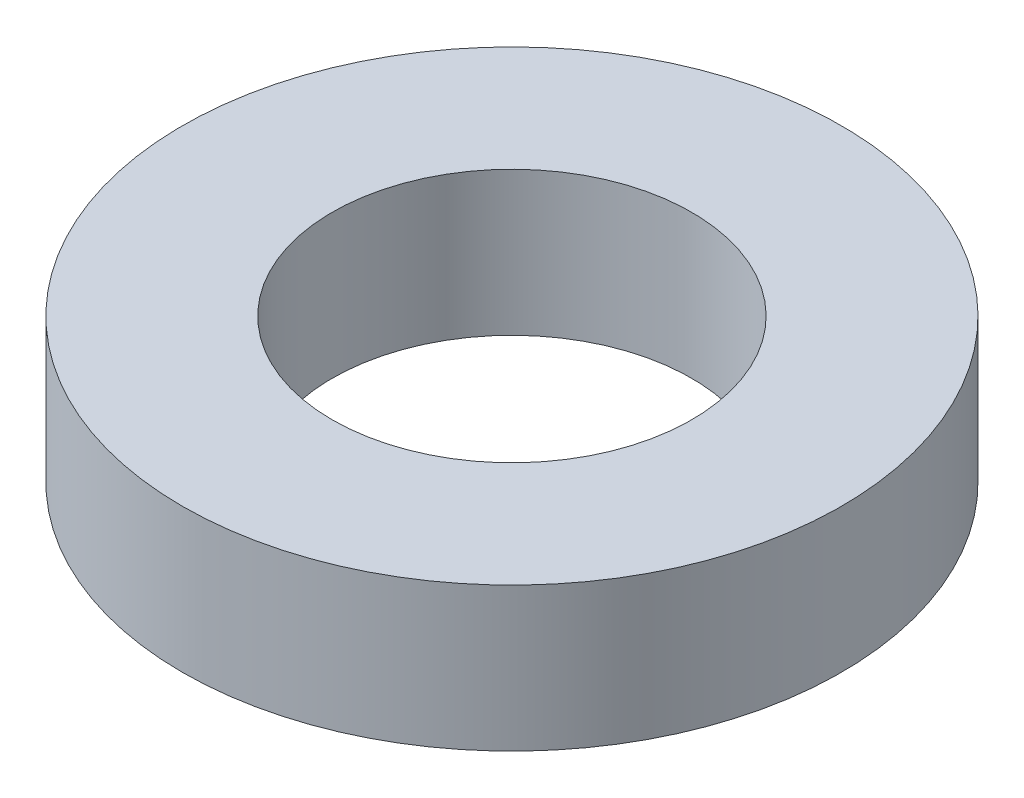
ISO-10303-21;
HEADER;
FILE_DESCRIPTION(('STEP AP214'),'2;1');
FILE_NAME('part.step','',(''),(''),'','','');
FILE_SCHEMA(('AUTOMOTIVE_DESIGN { 1 0 10303 214 1 1 1 1 }'));
ENDSEC;
DATA;
#1=APPLICATION_CONTEXT('core data for automotive mechanical design processes');
#2=APPLICATION_PROTOCOL_DEFINITION('international standard','automotive_design',2000,#1);
#3=PRODUCT_CONTEXT('',#1,'mechanical');
#4=PRODUCT('Part','Part','',(#3));
#5=PRODUCT_RELATED_PRODUCT_CATEGORY('part','',(#4));
#6=PRODUCT_DEFINITION_FORMATION('','',#4);
#7=PRODUCT_DEFINITION_CONTEXT('part definition',#1,'design');
#8=PRODUCT_DEFINITION('design','',#6,#7);
#9=PRODUCT_DEFINITION_SHAPE('','',#8);
#10=(LENGTH_UNIT() NAMED_UNIT(*) SI_UNIT(.MILLI.,.METRE.));
#11=(NAMED_UNIT(*) PLANE_ANGLE_UNIT() SI_UNIT($,.RADIAN.));
#12=(NAMED_UNIT(*) SI_UNIT($,.STERADIAN.) SOLID_ANGLE_UNIT());
#13=UNCERTAINTY_MEASURE_WITH_UNIT(LENGTH_MEASURE(1.E-05),#10,'distance_accuracy_value','');
#14=(GEOMETRIC_REPRESENTATION_CONTEXT(3) GLOBAL_UNCERTAINTY_ASSIGNED_CONTEXT((#13)) GLOBAL_UNIT_ASSIGNED_CONTEXT((#10,
#11,#12)) REPRESENTATION_CONTEXT('',''));
#15=CARTESIAN_POINT('',(0.,0.,0.));
#16=DIRECTION('',(0.,0.,1.));
#17=DIRECTION('',(1.,0.,0.));
#18=AXIS2_PLACEMENT_3D('',#15,#16,#17);
#19=CARTESIAN_POINT('',(0.,24.,0.));
#20=DIRECTION('',(0.,-1.,0.));
#21=DIRECTION('',(0.,0.,-1.));
#22=AXIS2_PLACEMENT_3D('',#19,#20,#21);
#23=CYLINDRICAL_SURFACE('',#22,55.);
#24=CARTESIAN_POINT('',(0.,24.,0.));
#25=DIRECTION('',(0.,1.,0.));
#26=DIRECTION('',(0.,0.,1.));
#27=AXIS2_PLACEMENT_3D('',#24,#25,#26);
#28=CIRCLE('',#27,55.);
#29=CARTESIAN_POINT('',(0.,24.,55.));
#30=VERTEX_POINT('',#29);
#31=EDGE_CURVE('E10',#30,#30,#28,.T.);
#32=ORIENTED_EDGE('',*,*,#31,.F.);
#33=EDGE_LOOP('',(#32));
#34=FACE_BOUND('',#33,.T.);
#35=CARTESIAN_POINT('',(0.,0.,0.));
#36=DIRECTION('',(0.,1.,0.));
#37=DIRECTION('',(0.,0.,1.));
#38=AXIS2_PLACEMENT_3D('',#35,#36,#37);
#39=CIRCLE('',#38,55.);
#40=CARTESIAN_POINT('',(0.,0.,55.));
#41=VERTEX_POINT('',#40);
#42=EDGE_CURVE('E37',#41,#41,#39,.T.);
#43=ORIENTED_EDGE('',*,*,#42,.T.);
#44=EDGE_LOOP('',(#43));
#45=FACE_BOUND('',#44,.T.);
#46=ADVANCED_FACE('F40',(#34,#45),#23,.T.);
#47=CARTESIAN_POINT('',(0.,24.,0.));
#48=DIRECTION('',(0.,1.,0.));
#49=DIRECTION('',(0.,0.,1.));
#50=AXIS2_PLACEMENT_3D('',#47,#48,#49);
#51=PLANE('',#50);
#52=CARTESIAN_POINT('',(0.,24.,0.));
#53=DIRECTION('',(0.,1.,0.));
#54=DIRECTION('',(0.,0.,1.));
#55=AXIS2_PLACEMENT_3D('',#52,#53,#54);
#56=CIRCLE('',#55,30.);
#57=CARTESIAN_POINT('',(0.,24.,30.));
#58=VERTEX_POINT('',#57);
#59=EDGE_CURVE('E50',#58,#58,#56,.T.);
#60=ORIENTED_EDGE('',*,*,#59,.F.);
#61=EDGE_LOOP('',(#60));
#62=FACE_BOUND('',#61,.T.);
#63=ORIENTED_EDGE('',*,*,#31,.T.);
#64=EDGE_LOOP('',(#63));
#65=FACE_BOUND('',#64,.T.);
#66=ADVANCED_FACE('F59',(#62,#65),#51,.T.);
#67=CARTESIAN_POINT('',(0.,0.,0.));
#68=DIRECTION('',(0.,1.,0.));
#69=DIRECTION('',(0.,0.,1.));
#70=AXIS2_PLACEMENT_3D('',#67,#68,#69);
#71=PLANE('',#70);
#72=CARTESIAN_POINT('',(0.,0.,0.));
#73=DIRECTION('',(0.,1.,0.));
#74=DIRECTION('',(0.,0.,1.));
#75=AXIS2_PLACEMENT_3D('',#72,#73,#74);
#76=CIRCLE('',#75,30.);
#77=CARTESIAN_POINT('',(0.,0.,30.));
#78=VERTEX_POINT('',#77);
#79=EDGE_CURVE('E47',#78,#78,#76,.T.);
#80=ORIENTED_EDGE('',*,*,#79,.T.);
#81=EDGE_LOOP('',(#80));
#82=FACE_BOUND('',#81,.T.);
#83=ORIENTED_EDGE('',*,*,#42,.F.);
#84=EDGE_LOOP('',(#83));
#85=FACE_BOUND('',#84,.T.);
#86=ADVANCED_FACE('F58',(#82,#85),#71,.F.);
#87=CARTESIAN_POINT('',(0.,24.,0.));
#88=DIRECTION('',(0.,-1.,0.));
#89=DIRECTION('',(0.,0.,-1.));
#90=AXIS2_PLACEMENT_3D('',#87,#88,#89);
#91=CYLINDRICAL_SURFACE('',#90,30.);
#92=ORIENTED_EDGE('',*,*,#59,.T.);
#93=EDGE_LOOP('',(#92));
#94=FACE_BOUND('',#93,.T.);
#95=ORIENTED_EDGE('',*,*,#79,.F.);
#96=EDGE_LOOP('',(#95));
#97=FACE_BOUND('',#96,.T.);
#98=ADVANCED_FACE('F54',(#94,#97),#91,.F.);
#99=CLOSED_SHELL('',(#46,#66,#86,#98));
#100=MANIFOLD_SOLID_BREP('B2',#99);
#101=ADVANCED_BREP_SHAPE_REPRESENTATION('',(#18,#100),#14);
#102=SHAPE_DEFINITION_REPRESENTATION(#9,#101);
ENDSEC;
END-ISO-10303-21;
